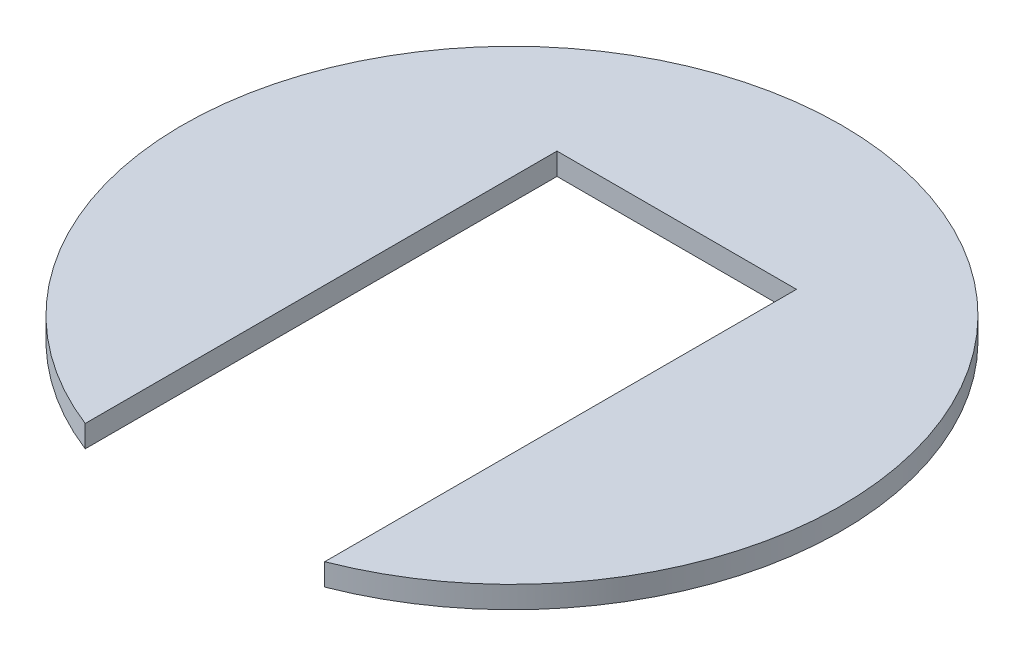
ISO-10303-21;
HEADER;
FILE_DESCRIPTION(('STEP AP214'),'2;1');
FILE_NAME('part.step','',(''),(''),'','','');
FILE_SCHEMA(('AUTOMOTIVE_DESIGN { 1 0 10303 214 1 1 1 1 }'));
ENDSEC;
DATA;
#1=APPLICATION_CONTEXT('core data for automotive mechanical design processes');
#2=APPLICATION_PROTOCOL_DEFINITION('international standard','automotive_design',2000,#1);
#3=PRODUCT_CONTEXT('',#1,'mechanical');
#4=PRODUCT('Part','Part','',(#3));
#5=PRODUCT_RELATED_PRODUCT_CATEGORY('part','',(#4));
#6=PRODUCT_DEFINITION_FORMATION('','',#4);
#7=PRODUCT_DEFINITION_CONTEXT('part definition',#1,'design');
#8=PRODUCT_DEFINITION('design','',#6,#7);
#9=PRODUCT_DEFINITION_SHAPE('','',#8);
#10=(LENGTH_UNIT() NAMED_UNIT(*) SI_UNIT(.MILLI.,.METRE.));
#11=(NAMED_UNIT(*) PLANE_ANGLE_UNIT() SI_UNIT($,.RADIAN.));
#12=(NAMED_UNIT(*) SI_UNIT($,.STERADIAN.) SOLID_ANGLE_UNIT());
#13=UNCERTAINTY_MEASURE_WITH_UNIT(LENGTH_MEASURE(1.E-05),#10,'distance_accuracy_value','');
#14=(GEOMETRIC_REPRESENTATION_CONTEXT(3) GLOBAL_UNCERTAINTY_ASSIGNED_CONTEXT((#13)) GLOBAL_UNIT_ASSIGNED_CONTEXT((#10,
#11,#12)) REPRESENTATION_CONTEXT('',''));
#15=CARTESIAN_POINT('',(0.,0.,0.));
#16=DIRECTION('',(0.,0.,1.));
#17=DIRECTION('',(1.,0.,0.));
#18=AXIS2_PLACEMENT_3D('',#15,#16,#17);
#19=CARTESIAN_POINT('',(0.,10.,0.));
#20=DIRECTION('',(0.,-1.,0.));
#21=DIRECTION('',(0.,0.,-1.));
#22=AXIS2_PLACEMENT_3D('',#19,#20,#21);
#23=CYLINDRICAL_SURFACE('',#22,150.);
#24=CARTESIAN_POINT('',(0.,0.,0.));
#25=DIRECTION('',(0.,1.,0.));
#26=DIRECTION('',(0.,0.,1.));
#27=AXIS2_PLACEMENT_3D('',#24,#25,#26);
#28=CIRCLE('',#27,150.);
#29=CARTESIAN_POINT('',(54.5,0.,139.748881927549));
#30=VERTEX_POINT('',#29);
#31=CARTESIAN_POINT('',(-54.5,0.,139.748881927549));
#32=VERTEX_POINT('',#31);
#33=EDGE_CURVE('E95',#30,#32,#28,.T.);
#34=ORIENTED_EDGE('',*,*,#33,.T.);
#35=DIRECTION('',(0.,-1.,0.));
#36=VECTOR('',#35,1.);
#37=CARTESIAN_POINT('',(-54.5,10.,139.748881927549));
#38=LINE('',#37,#36);
#39=CARTESIAN_POINT('',(-54.5,10.,139.748881927549));
#40=VERTEX_POINT('',#39);
#41=EDGE_CURVE('E11',#40,#32,#38,.T.);
#42=ORIENTED_EDGE('',*,*,#41,.F.);
#43=CARTESIAN_POINT('',(0.,10.,0.));
#44=DIRECTION('',(0.,1.,0.));
#45=DIRECTION('',(0.,0.,1.));
#46=AXIS2_PLACEMENT_3D('',#43,#44,#45);
#47=CIRCLE('',#46,150.);
#48=CARTESIAN_POINT('',(54.5,10.,139.748881927549));
#49=VERTEX_POINT('',#48);
#50=EDGE_CURVE('E83',#49,#40,#47,.T.);
#51=ORIENTED_EDGE('',*,*,#50,.F.);
#52=DIRECTION('',(0.,-1.,0.));
#53=VECTOR('',#52,1.);
#54=CARTESIAN_POINT('',(54.5,10.,139.748881927549));
#55=LINE('',#54,#53);
#56=EDGE_CURVE('E91',#49,#30,#55,.T.);
#57=ORIENTED_EDGE('',*,*,#56,.T.);
#58=EDGE_LOOP('',(#34,#42,#51,#57));
#59=FACE_BOUND('',#58,.T.);
#60=ADVANCED_FACE('F32',(#59),#23,.T.);
#61=CARTESIAN_POINT('',(-54.5,10.,139.748881927549));
#62=DIRECTION('',(-1.,0.,0.));
#63=DIRECTION('',(0.,0.,1.));
#64=AXIS2_PLACEMENT_3D('',#61,#62,#63);
#65=PLANE('',#64);
#66=DIRECTION('',(0.,0.,-1.));
#67=VECTOR('',#66,1.);
#68=CARTESIAN_POINT('',(-54.5,0.,139.748881927549));
#69=LINE('',#68,#67);
#70=CARTESIAN_POINT('',(-54.5,0.,-75.));
#71=VERTEX_POINT('',#70);
#72=EDGE_CURVE('E87',#32,#71,#69,.T.);
#73=ORIENTED_EDGE('',*,*,#72,.T.);
#74=DIRECTION('',(0.,-1.,0.));
#75=VECTOR('',#74,1.);
#76=CARTESIAN_POINT('',(-54.5,10.,-75.));
#77=LINE('',#76,#75);
#78=CARTESIAN_POINT('',(-54.5,10.,-75.));
#79=VERTEX_POINT('',#78);
#80=EDGE_CURVE('E40',#79,#71,#77,.T.);
#81=ORIENTED_EDGE('',*,*,#80,.F.);
#82=DIRECTION('',(0.,0.,-1.));
#83=VECTOR('',#82,1.);
#84=CARTESIAN_POINT('',(-54.5,10.,139.748881927549));
#85=LINE('',#84,#83);
#86=EDGE_CURVE('E78',#40,#79,#85,.T.);
#87=ORIENTED_EDGE('',*,*,#86,.F.);
#88=ORIENTED_EDGE('',*,*,#41,.T.);
#89=EDGE_LOOP('',(#73,#81,#87,#88));
#90=FACE_BOUND('',#89,.T.);
#91=ADVANCED_FACE('F86',(#90),#65,.F.);
#92=CARTESIAN_POINT('',(-54.5,10.,-75.));
#93=DIRECTION('',(0.,0.,-1.));
#94=DIRECTION('',(-1.,0.,0.));
#95=AXIS2_PLACEMENT_3D('',#92,#93,#94);
#96=PLANE('',#95);
#97=DIRECTION('',(1.,0.,0.));
#98=VECTOR('',#97,1.);
#99=CARTESIAN_POINT('',(-54.5,0.,-75.));
#100=LINE('',#99,#98);
#101=CARTESIAN_POINT('',(54.5,0.,-75.));
#102=VERTEX_POINT('',#101);
#103=EDGE_CURVE('E65',#71,#102,#100,.T.);
#104=ORIENTED_EDGE('',*,*,#103,.T.);
#105=DIRECTION('',(0.,-1.,0.));
#106=VECTOR('',#105,1.);
#107=CARTESIAN_POINT('',(54.5,10.,-75.));
#108=LINE('',#107,#106);
#109=CARTESIAN_POINT('',(54.5,10.,-75.));
#110=VERTEX_POINT('',#109);
#111=EDGE_CURVE('E88',#110,#102,#108,.T.);
#112=ORIENTED_EDGE('',*,*,#111,.F.);
#113=DIRECTION('',(1.,0.,0.));
#114=VECTOR('',#113,1.);
#115=CARTESIAN_POINT('',(-54.5,10.,-75.));
#116=LINE('',#115,#114);
#117=EDGE_CURVE('E81',#79,#110,#116,.T.);
#118=ORIENTED_EDGE('',*,*,#117,.F.);
#119=ORIENTED_EDGE('',*,*,#80,.T.);
#120=EDGE_LOOP('',(#104,#112,#118,#119));
#121=FACE_BOUND('',#120,.T.);
#122=ADVANCED_FACE('F89',(#121),#96,.F.);
#123=CARTESIAN_POINT('',(54.5,10.,139.748881927549));
#124=DIRECTION('',(1.,0.,0.));
#125=DIRECTION('',(0.,0.,-1.));
#126=AXIS2_PLACEMENT_3D('',#123,#124,#125);
#127=PLANE('',#126);
#128=DIRECTION('',(0.,0.,1.));
#129=VECTOR('',#128,1.);
#130=CARTESIAN_POINT('',(54.5,0.,139.748881927549));
#131=LINE('',#130,#129);
#132=EDGE_CURVE('E71',#102,#30,#131,.T.);
#133=ORIENTED_EDGE('',*,*,#132,.T.);
#134=ORIENTED_EDGE('',*,*,#56,.F.);
#135=DIRECTION('',(0.,0.,1.));
#136=VECTOR('',#135,1.);
#137=CARTESIAN_POINT('',(54.5,10.,139.748881927549));
#138=LINE('',#137,#136);
#139=EDGE_CURVE('E48',#110,#49,#138,.T.);
#140=ORIENTED_EDGE('',*,*,#139,.F.);
#141=ORIENTED_EDGE('',*,*,#111,.T.);
#142=EDGE_LOOP('',(#133,#134,#140,#141));
#143=FACE_BOUND('',#142,.T.);
#144=ADVANCED_FACE('F102',(#143),#127,.F.);
#145=CARTESIAN_POINT('',(0.,10.,0.));
#146=DIRECTION('',(0.,1.,0.));
#147=DIRECTION('',(0.,0.,1.));
#148=AXIS2_PLACEMENT_3D('',#145,#146,#147);
#149=PLANE('',#148);
#150=ORIENTED_EDGE('',*,*,#50,.T.);
#151=ORIENTED_EDGE('',*,*,#86,.T.);
#152=ORIENTED_EDGE('',*,*,#117,.T.);
#153=ORIENTED_EDGE('',*,*,#139,.T.);
#154=EDGE_LOOP('',(#150,#151,#152,#153));
#155=FACE_BOUND('',#154,.T.);
#156=ADVANCED_FACE('F79',(#155),#149,.T.);
#157=CARTESIAN_POINT('',(0.,0.,0.));
#158=DIRECTION('',(0.,1.,0.));
#159=DIRECTION('',(0.,0.,1.));
#160=AXIS2_PLACEMENT_3D('',#157,#158,#159);
#161=PLANE('',#160);
#162=ORIENTED_EDGE('',*,*,#33,.F.);
#163=ORIENTED_EDGE('',*,*,#132,.F.);
#164=ORIENTED_EDGE('',*,*,#103,.F.);
#165=ORIENTED_EDGE('',*,*,#72,.F.);
#166=EDGE_LOOP('',(#162,#163,#164,#165));
#167=FACE_BOUND('',#166,.T.);
#168=ADVANCED_FACE('F105',(#167),#161,.F.);
#169=CLOSED_SHELL('',(#60,#91,#122,#144,#156,#168));
#170=MANIFOLD_SOLID_BREP('B2',#169);
#171=ADVANCED_BREP_SHAPE_REPRESENTATION('',(#18,#170),#14);
#172=SHAPE_DEFINITION_REPRESENTATION(#9,#171);
ENDSEC;
END-ISO-10303-21;
